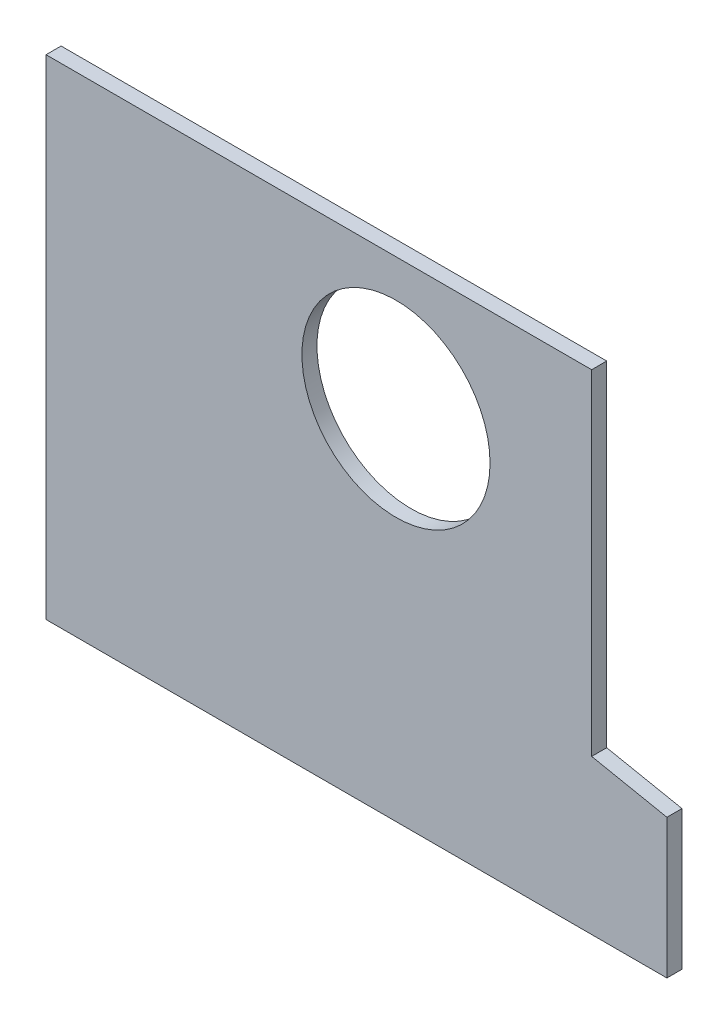
ISO-10303-21;
HEADER;
FILE_DESCRIPTION(('STEP AP214'),'2;1');
FILE_NAME('part.step','',(''),(''),'','','');
FILE_SCHEMA(('AUTOMOTIVE_DESIGN { 1 0 10303 214 1 1 1 1 }'));
ENDSEC;
DATA;
#1=APPLICATION_CONTEXT('core data for automotive mechanical design processes');
#2=APPLICATION_PROTOCOL_DEFINITION('international standard','automotive_design',2000,#1);
#3=PRODUCT_CONTEXT('',#1,'mechanical');
#4=PRODUCT('Part','Part','',(#3));
#5=PRODUCT_RELATED_PRODUCT_CATEGORY('part','',(#4));
#6=PRODUCT_DEFINITION_FORMATION('','',#4);
#7=PRODUCT_DEFINITION_CONTEXT('part definition',#1,'design');
#8=PRODUCT_DEFINITION('design','',#6,#7);
#9=PRODUCT_DEFINITION_SHAPE('','',#8);
#10=(LENGTH_UNIT() NAMED_UNIT(*) SI_UNIT(.MILLI.,.METRE.));
#11=(NAMED_UNIT(*) PLANE_ANGLE_UNIT() SI_UNIT($,.RADIAN.));
#12=(NAMED_UNIT(*) SI_UNIT($,.STERADIAN.) SOLID_ANGLE_UNIT());
#13=UNCERTAINTY_MEASURE_WITH_UNIT(LENGTH_MEASURE(1.E-05),#10,'distance_accuracy_value','');
#14=(GEOMETRIC_REPRESENTATION_CONTEXT(3) GLOBAL_UNCERTAINTY_ASSIGNED_CONTEXT((#13)) GLOBAL_UNIT_ASSIGNED_CONTEXT((#10,
#11,#12)) REPRESENTATION_CONTEXT('',''));
#15=CARTESIAN_POINT('',(0.,0.,0.));
#16=DIRECTION('',(0.,0.,1.));
#17=DIRECTION('',(1.,0.,0.));
#18=AXIS2_PLACEMENT_3D('',#15,#16,#17);
#19=CARTESIAN_POINT('',(0.,0.,4.));
#20=DIRECTION('',(0.,0.,1.));
#21=DIRECTION('',(1.,0.,0.));
#22=AXIS2_PLACEMENT_3D('',#19,#20,#21);
#23=PLANE('',#22);
#24=DIRECTION('',(0.,1.,0.));
#25=VECTOR('',#24,1.);
#26=CARTESIAN_POINT('',(82.5,37.,4.));
#27=LINE('',#26,#25);
#28=CARTESIAN_POINT('',(82.5,0.,4.));
#29=VERTEX_POINT('',#28);
#30=CARTESIAN_POINT('',(82.5,37.,4.));
#31=VERTEX_POINT('',#30);
#32=EDGE_CURVE('E130',#29,#31,#27,.T.);
#33=ORIENTED_EDGE('',*,*,#32,.T.);
#34=DIRECTION('',(-0.98058067569092,0.196116135138183,0.));
#35=VECTOR('',#34,1.);
#36=CARTESIAN_POINT('',(62.5,41.,4.));
#37=LINE('',#36,#35);
#38=CARTESIAN_POINT('',(62.5,41.,4.));
#39=VERTEX_POINT('',#38);
#40=EDGE_CURVE('E88',#31,#39,#37,.T.);
#41=ORIENTED_EDGE('',*,*,#40,.T.);
#42=DIRECTION('',(0.,1.,0.));
#43=VECTOR('',#42,1.);
#44=CARTESIAN_POINT('',(62.5,130.,4.));
#45=LINE('',#44,#43);
#46=CARTESIAN_POINT('',(62.5,130.,4.));
#47=VERTEX_POINT('',#46);
#48=EDGE_CURVE('E101',#39,#47,#45,.T.);
#49=ORIENTED_EDGE('',*,*,#48,.T.);
#50=DIRECTION('',(-1.,0.,0.));
#51=VECTOR('',#50,1.);
#52=CARTESIAN_POINT('',(-82.5,130.,4.));
#53=LINE('',#52,#51);
#54=CARTESIAN_POINT('',(-82.5,130.,4.));
#55=VERTEX_POINT('',#54);
#56=EDGE_CURVE('E95',#47,#55,#53,.T.);
#57=ORIENTED_EDGE('',*,*,#56,.T.);
#58=DIRECTION('',(0.,-1.,0.));
#59=VECTOR('',#58,1.);
#60=CARTESIAN_POINT('',(-82.5,0.,4.));
#61=LINE('',#60,#59);
#62=CARTESIAN_POINT('',(-82.5,0.,4.));
#63=VERTEX_POINT('',#62);
#64=EDGE_CURVE('E99',#55,#63,#61,.T.);
#65=ORIENTED_EDGE('',*,*,#64,.T.);
#66=DIRECTION('',(1.,0.,0.));
#67=VECTOR('',#66,1.);
#68=CARTESIAN_POINT('',(-82.5,0.,4.));
#69=LINE('',#68,#67);
#70=EDGE_CURVE('E51',#63,#29,#69,.T.);
#71=ORIENTED_EDGE('',*,*,#70,.T.);
#72=EDGE_LOOP('',(#33,#41,#49,#57,#65,#71));
#73=FACE_BOUND('',#72,.T.);
#74=CARTESIAN_POINT('',(10.5,95.,4.));
#75=DIRECTION('',(0.,0.,1.));
#76=DIRECTION('',(1.,0.,0.));
#77=AXIS2_PLACEMENT_3D('',#74,#75,#76);
#78=CIRCLE('',#77,25.);
#79=CARTESIAN_POINT('',(35.5,95.,4.));
#80=VERTEX_POINT('',#79);
#81=EDGE_CURVE('E123',#80,#80,#78,.T.);
#82=ORIENTED_EDGE('',*,*,#81,.F.);
#83=EDGE_LOOP('',(#82));
#84=FACE_BOUND('',#83,.T.);
#85=ADVANCED_FACE('F34',(#73,#84),#23,.T.);
#86=CARTESIAN_POINT('',(0.,0.,0.));
#87=DIRECTION('',(0.,0.,1.));
#88=DIRECTION('',(1.,0.,0.));
#89=AXIS2_PLACEMENT_3D('',#86,#87,#88);
#90=PLANE('',#89);
#91=DIRECTION('',(0.,1.,0.));
#92=VECTOR('',#91,1.);
#93=CARTESIAN_POINT('',(82.5,37.,0.));
#94=LINE('',#93,#92);
#95=CARTESIAN_POINT('',(82.5,0.,0.));
#96=VERTEX_POINT('',#95);
#97=CARTESIAN_POINT('',(82.5,37.,0.));
#98=VERTEX_POINT('',#97);
#99=EDGE_CURVE('E119',#96,#98,#94,.T.);
#100=ORIENTED_EDGE('',*,*,#99,.F.);
#101=DIRECTION('',(1.,0.,0.));
#102=VECTOR('',#101,1.);
#103=CARTESIAN_POINT('',(-82.5,0.,0.));
#104=LINE('',#103,#102);
#105=CARTESIAN_POINT('',(-82.5,0.,0.));
#106=VERTEX_POINT('',#105);
#107=EDGE_CURVE('E80',#106,#96,#104,.T.);
#108=ORIENTED_EDGE('',*,*,#107,.F.);
#109=DIRECTION('',(0.,-1.,0.));
#110=VECTOR('',#109,1.);
#111=CARTESIAN_POINT('',(-82.5,0.,0.));
#112=LINE('',#111,#110);
#113=CARTESIAN_POINT('',(-82.5,130.,0.));
#114=VERTEX_POINT('',#113);
#115=EDGE_CURVE('E74',#114,#106,#112,.T.);
#116=ORIENTED_EDGE('',*,*,#115,.F.);
#117=DIRECTION('',(-1.,0.,0.));
#118=VECTOR('',#117,1.);
#119=CARTESIAN_POINT('',(-82.5,130.,0.));
#120=LINE('',#119,#118);
#121=CARTESIAN_POINT('',(62.5,130.,0.));
#122=VERTEX_POINT('',#121);
#123=EDGE_CURVE('E109',#122,#114,#120,.T.);
#124=ORIENTED_EDGE('',*,*,#123,.F.);
#125=DIRECTION('',(0.,1.,0.));
#126=VECTOR('',#125,1.);
#127=CARTESIAN_POINT('',(62.5,130.,0.));
#128=LINE('',#127,#126);
#129=CARTESIAN_POINT('',(62.5,41.,0.));
#130=VERTEX_POINT('',#129);
#131=EDGE_CURVE('E125',#130,#122,#128,.T.);
#132=ORIENTED_EDGE('',*,*,#131,.F.);
#133=DIRECTION('',(-0.98058067569092,0.196116135138183,0.));
#134=VECTOR('',#133,1.);
#135=CARTESIAN_POINT('',(62.5,41.,0.));
#136=LINE('',#135,#134);
#137=EDGE_CURVE('E122',#98,#130,#136,.T.);
#138=ORIENTED_EDGE('',*,*,#137,.F.);
#139=EDGE_LOOP('',(#100,#108,#116,#124,#132,#138));
#140=FACE_BOUND('',#139,.T.);
#141=CARTESIAN_POINT('',(10.5,95.,0.));
#142=DIRECTION('',(0.,0.,1.));
#143=DIRECTION('',(1.,0.,0.));
#144=AXIS2_PLACEMENT_3D('',#141,#142,#143);
#145=CIRCLE('',#144,25.);
#146=CARTESIAN_POINT('',(35.5,95.,0.));
#147=VERTEX_POINT('',#146);
#148=EDGE_CURVE('E223',#147,#147,#145,.T.);
#149=ORIENTED_EDGE('',*,*,#148,.T.);
#150=EDGE_LOOP('',(#149));
#151=FACE_BOUND('',#150,.T.);
#152=ADVANCED_FACE('F139',(#140,#151),#90,.F.);
#153=CARTESIAN_POINT('',(82.5,37.,4.));
#154=DIRECTION('',(-1.,0.,0.));
#155=DIRECTION('',(0.,-1.,0.));
#156=AXIS2_PLACEMENT_3D('',#153,#154,#155);
#157=PLANE('',#156);
#158=ORIENTED_EDGE('',*,*,#99,.T.);
#159=DIRECTION('',(0.,0.,-1.));
#160=VECTOR('',#159,1.);
#161=CARTESIAN_POINT('',(82.5,37.,4.));
#162=LINE('',#161,#160);
#163=EDGE_CURVE('E11',#31,#98,#162,.T.);
#164=ORIENTED_EDGE('',*,*,#163,.F.);
#165=ORIENTED_EDGE('',*,*,#32,.F.);
#166=DIRECTION('',(0.,0.,-1.));
#167=VECTOR('',#166,1.);
#168=CARTESIAN_POINT('',(82.5,0.,4.));
#169=LINE('',#168,#167);
#170=EDGE_CURVE('E115',#29,#96,#169,.T.);
#171=ORIENTED_EDGE('',*,*,#170,.T.);
#172=EDGE_LOOP('',(#158,#164,#165,#171));
#173=FACE_BOUND('',#172,.T.);
#174=ADVANCED_FACE('F36',(#173),#157,.F.);
#175=CARTESIAN_POINT('',(62.5,41.,4.));
#176=DIRECTION('',(-0.196116135138183,-0.98058067569092,0.));
#177=DIRECTION('',(0.98058067569092,-0.196116135138183,0.));
#178=AXIS2_PLACEMENT_3D('',#175,#176,#177);
#179=PLANE('',#178);
#180=ORIENTED_EDGE('',*,*,#137,.T.);
#181=DIRECTION('',(0.,0.,-1.));
#182=VECTOR('',#181,1.);
#183=CARTESIAN_POINT('',(62.5,41.,4.));
#184=LINE('',#183,#182);
#185=EDGE_CURVE('E43',#39,#130,#184,.T.);
#186=ORIENTED_EDGE('',*,*,#185,.F.);
#187=ORIENTED_EDGE('',*,*,#40,.F.);
#188=ORIENTED_EDGE('',*,*,#163,.T.);
#189=EDGE_LOOP('',(#180,#186,#187,#188));
#190=FACE_BOUND('',#189,.T.);
#191=ADVANCED_FACE('F164',(#190),#179,.F.);
#192=CARTESIAN_POINT('',(62.5,130.,4.));
#193=DIRECTION('',(-1.,0.,0.));
#194=DIRECTION('',(0.,-1.,0.));
#195=AXIS2_PLACEMENT_3D('',#192,#193,#194);
#196=PLANE('',#195);
#197=ORIENTED_EDGE('',*,*,#131,.T.);
#198=DIRECTION('',(0.,0.,-1.));
#199=VECTOR('',#198,1.);
#200=CARTESIAN_POINT('',(62.5,130.,4.));
#201=LINE('',#200,#199);
#202=EDGE_CURVE('E110',#47,#122,#201,.T.);
#203=ORIENTED_EDGE('',*,*,#202,.F.);
#204=ORIENTED_EDGE('',*,*,#48,.F.);
#205=ORIENTED_EDGE('',*,*,#185,.T.);
#206=EDGE_LOOP('',(#197,#203,#204,#205));
#207=FACE_BOUND('',#206,.T.);
#208=ADVANCED_FACE('F136',(#207),#196,.F.);
#209=CARTESIAN_POINT('',(-82.5,130.,4.));
#210=DIRECTION('',(0.,-1.,0.));
#211=DIRECTION('',(0.,0.,-1.));
#212=AXIS2_PLACEMENT_3D('',#209,#210,#211);
#213=PLANE('',#212);
#214=ORIENTED_EDGE('',*,*,#123,.T.);
#215=DIRECTION('',(0.,0.,-1.));
#216=VECTOR('',#215,1.);
#217=CARTESIAN_POINT('',(-82.5,130.,4.));
#218=LINE('',#217,#216);
#219=EDGE_CURVE('E106',#55,#114,#218,.T.);
#220=ORIENTED_EDGE('',*,*,#219,.F.);
#221=ORIENTED_EDGE('',*,*,#56,.F.);
#222=ORIENTED_EDGE('',*,*,#202,.T.);
#223=EDGE_LOOP('',(#214,#220,#221,#222));
#224=FACE_BOUND('',#223,.T.);
#225=ADVANCED_FACE('F107',(#224),#213,.F.);
#226=CARTESIAN_POINT('',(-82.5,0.,4.));
#227=DIRECTION('',(1.,0.,0.));
#228=DIRECTION('',(0.,0.,-1.));
#229=AXIS2_PLACEMENT_3D('',#226,#227,#228);
#230=PLANE('',#229);
#231=ORIENTED_EDGE('',*,*,#115,.T.);
#232=DIRECTION('',(0.,0.,-1.));
#233=VECTOR('',#232,1.);
#234=CARTESIAN_POINT('',(-82.5,0.,4.));
#235=LINE('',#234,#233);
#236=EDGE_CURVE('E111',#63,#106,#235,.T.);
#237=ORIENTED_EDGE('',*,*,#236,.F.);
#238=ORIENTED_EDGE('',*,*,#64,.F.);
#239=ORIENTED_EDGE('',*,*,#219,.T.);
#240=EDGE_LOOP('',(#231,#237,#238,#239));
#241=FACE_BOUND('',#240,.T.);
#242=ADVANCED_FACE('F113',(#241),#230,.F.);
#243=CARTESIAN_POINT('',(-82.5,0.,4.));
#244=DIRECTION('',(0.,1.,0.));
#245=DIRECTION('',(0.,0.,1.));
#246=AXIS2_PLACEMENT_3D('',#243,#244,#245);
#247=PLANE('',#246);
#248=ORIENTED_EDGE('',*,*,#107,.T.);
#249=ORIENTED_EDGE('',*,*,#170,.F.);
#250=ORIENTED_EDGE('',*,*,#70,.F.);
#251=ORIENTED_EDGE('',*,*,#236,.T.);
#252=EDGE_LOOP('',(#248,#249,#250,#251));
#253=FACE_BOUND('',#252,.T.);
#254=ADVANCED_FACE('F144',(#253),#247,.F.);
#255=CARTESIAN_POINT('',(10.5,95.,4.));
#256=DIRECTION('',(0.,0.,-1.));
#257=DIRECTION('',(-1.,0.,0.));
#258=AXIS2_PLACEMENT_3D('',#255,#256,#257);
#259=CYLINDRICAL_SURFACE('',#258,25.);
#260=ORIENTED_EDGE('',*,*,#81,.T.);
#261=EDGE_LOOP('',(#260));
#262=FACE_BOUND('',#261,.T.);
#263=ORIENTED_EDGE('',*,*,#148,.F.);
#264=EDGE_LOOP('',(#263));
#265=FACE_BOUND('',#264,.T.);
#266=ADVANCED_FACE('F146',(#262,#265),#259,.F.);
#267=CLOSED_SHELL('',(#85,#152,#174,#191,#208,#225,#242,#254,#266));
#268=MANIFOLD_SOLID_BREP('B2',#267);
#269=ADVANCED_BREP_SHAPE_REPRESENTATION('',(#18,#268),#14);
#270=SHAPE_DEFINITION_REPRESENTATION(#9,#269);
ENDSEC;
END-ISO-10303-21;
